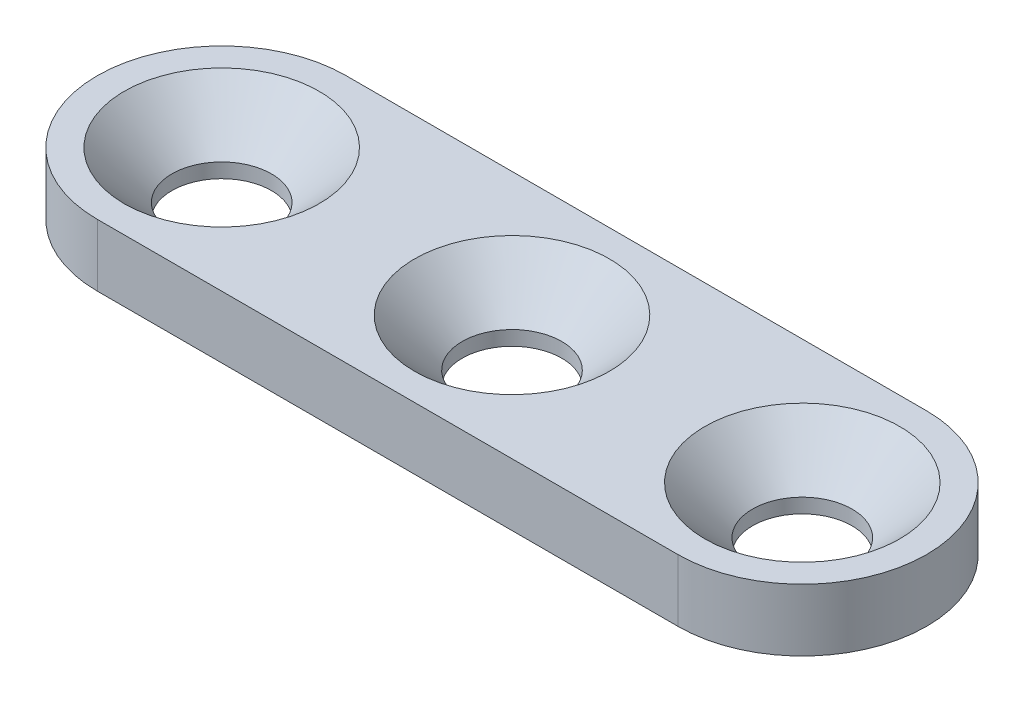
ISO-10303-21;
HEADER;
FILE_DESCRIPTION(('STEP AP214'),'2;1');
FILE_NAME('part.step','',(''),(''),'','','');
FILE_SCHEMA(('AUTOMOTIVE_DESIGN { 1 0 10303 214 1 1 1 1 }'));
ENDSEC;
DATA;
#1=APPLICATION_CONTEXT('core data for automotive mechanical design processes');
#2=APPLICATION_PROTOCOL_DEFINITION('international standard','automotive_design',2000,#1);
#3=PRODUCT_CONTEXT('',#1,'mechanical');
#4=PRODUCT('Part','Part','',(#3));
#5=PRODUCT_RELATED_PRODUCT_CATEGORY('part','',(#4));
#6=PRODUCT_DEFINITION_FORMATION('','',#4);
#7=PRODUCT_DEFINITION_CONTEXT('part definition',#1,'design');
#8=PRODUCT_DEFINITION('design','',#6,#7);
#9=PRODUCT_DEFINITION_SHAPE('','',#8);
#10=(LENGTH_UNIT() NAMED_UNIT(*) SI_UNIT(.MILLI.,.METRE.));
#11=(NAMED_UNIT(*) PLANE_ANGLE_UNIT() SI_UNIT($,.RADIAN.));
#12=(NAMED_UNIT(*) SI_UNIT($,.STERADIAN.) SOLID_ANGLE_UNIT());
#13=UNCERTAINTY_MEASURE_WITH_UNIT(LENGTH_MEASURE(1.E-05),#10,'distance_accuracy_value','');
#14=(GEOMETRIC_REPRESENTATION_CONTEXT(3) GLOBAL_UNCERTAINTY_ASSIGNED_CONTEXT((#13)) GLOBAL_UNIT_ASSIGNED_CONTEXT((#10,
#11,#12)) REPRESENTATION_CONTEXT('',''));
#15=CARTESIAN_POINT('',(0.,0.,0.));
#16=DIRECTION('',(0.,0.,1.));
#17=DIRECTION('',(1.,0.,0.));
#18=AXIS2_PLACEMENT_3D('',#15,#16,#17);
#19=CARTESIAN_POINT('',(-28.,3.,0.));
#20=DIRECTION('',(0.,1.,0.));
#21=DIRECTION('',(0.,0.,1.));
#22=AXIS2_PLACEMENT_3D('',#19,#20,#21);
#23=PLANE('',#22);
#24=CARTESIAN_POINT('',(-28.,3.,0.));
#25=DIRECTION('',(0.,1.,0.));
#26=DIRECTION('',(0.,0.,1.));
#27=AXIS2_PLACEMENT_3D('',#24,#25,#26);
#28=CIRCLE('',#27,4.7);
#29=CARTESIAN_POINT('',(-28.,3.,4.7));
#30=VERTEX_POINT('',#29);
#31=EDGE_CURVE('E195',#30,#30,#28,.T.);
#32=ORIENTED_EDGE('',*,*,#31,.F.);
#33=EDGE_LOOP('',(#32));
#34=FACE_BOUND('',#33,.T.);
#35=CARTESIAN_POINT('',(0.,3.,0.));
#36=DIRECTION('',(0.,1.,0.));
#37=DIRECTION('',(0.,0.,1.));
#38=AXIS2_PLACEMENT_3D('',#35,#36,#37);
#39=CIRCLE('',#38,4.7);
#40=CARTESIAN_POINT('',(0.,3.,4.7));
#41=VERTEX_POINT('',#40);
#42=EDGE_CURVE('E152',#41,#41,#39,.T.);
#43=ORIENTED_EDGE('',*,*,#42,.F.);
#44=EDGE_LOOP('',(#43));
#45=FACE_BOUND('',#44,.T.);
#46=CARTESIAN_POINT('',(-14.,3.,0.));
#47=DIRECTION('',(0.,1.,0.));
#48=DIRECTION('',(0.,0.,1.));
#49=AXIS2_PLACEMENT_3D('',#46,#47,#48);
#50=CIRCLE('',#49,4.7);
#51=CARTESIAN_POINT('',(-14.,3.,4.7));
#52=VERTEX_POINT('',#51);
#53=EDGE_CURVE('E141',#52,#52,#50,.T.);
#54=ORIENTED_EDGE('',*,*,#53,.F.);
#55=EDGE_LOOP('',(#54));
#56=FACE_BOUND('',#55,.T.);
#57=CARTESIAN_POINT('',(-28.,3.,0.));
#58=DIRECTION('',(0.,1.,0.));
#59=DIRECTION('',(0.,0.,1.));
#60=AXIS2_PLACEMENT_3D('',#57,#58,#59);
#61=CIRCLE('',#60,6.);
#62=CARTESIAN_POINT('',(-28.,3.,-6.));
#63=VERTEX_POINT('',#62);
#64=CARTESIAN_POINT('',(-28.,3.,6.));
#65=VERTEX_POINT('',#64);
#66=EDGE_CURVE('E101',#63,#65,#61,.T.);
#67=ORIENTED_EDGE('',*,*,#66,.T.);
#68=DIRECTION('',(1.,0.,0.));
#69=VECTOR('',#68,1.);
#70=CARTESIAN_POINT('',(-28.,3.,6.));
#71=LINE('',#70,#69);
#72=CARTESIAN_POINT('',(0.,3.,6.));
#73=VERTEX_POINT('',#72);
#74=EDGE_CURVE('E97',#65,#73,#71,.T.);
#75=ORIENTED_EDGE('',*,*,#74,.T.);
#76=CARTESIAN_POINT('',(0.,3.,0.));
#77=DIRECTION('',(0.,1.,0.));
#78=DIRECTION('',(0.,0.,1.));
#79=AXIS2_PLACEMENT_3D('',#76,#77,#78);
#80=CIRCLE('',#79,6.);
#81=CARTESIAN_POINT('',(0.,3.,-6.));
#82=VERTEX_POINT('',#81);
#83=EDGE_CURVE('E99',#73,#82,#80,.T.);
#84=ORIENTED_EDGE('',*,*,#83,.T.);
#85=DIRECTION('',(-1.,0.,0.));
#86=VECTOR('',#85,1.);
#87=CARTESIAN_POINT('',(-28.,3.,-6.));
#88=LINE('',#87,#86);
#89=EDGE_CURVE('E67',#82,#63,#88,.T.);
#90=ORIENTED_EDGE('',*,*,#89,.T.);
#91=EDGE_LOOP('',(#67,#75,#84,#90));
#92=FACE_BOUND('',#91,.T.);
#93=ADVANCED_FACE('F47',(#34,#45,#56,#92),#23,.T.);
#94=CARTESIAN_POINT('',(-28.,0.,0.));
#95=DIRECTION('',(0.,1.,0.));
#96=DIRECTION('',(0.,0.,1.));
#97=AXIS2_PLACEMENT_3D('',#94,#95,#96);
#98=PLANE('',#97);
#99=CARTESIAN_POINT('',(-28.,0.,0.));
#100=DIRECTION('',(0.,1.,0.));
#101=DIRECTION('',(0.,0.,1.));
#102=AXIS2_PLACEMENT_3D('',#99,#100,#101);
#103=CIRCLE('',#102,2.39999999999999);
#104=CARTESIAN_POINT('',(-28.,0.,2.39999999999999));
#105=VERTEX_POINT('',#104);
#106=EDGE_CURVE('E51',#105,#105,#103,.T.);
#107=ORIENTED_EDGE('',*,*,#106,.T.);
#108=EDGE_LOOP('',(#107));
#109=FACE_BOUND('',#108,.T.);
#110=CARTESIAN_POINT('',(0.,0.,0.));
#111=DIRECTION('',(0.,1.,0.));
#112=DIRECTION('',(0.,0.,1.));
#113=AXIS2_PLACEMENT_3D('',#110,#111,#112);
#114=CIRCLE('',#113,2.39999999999999);
#115=CARTESIAN_POINT('',(0.,0.,2.39999999999999));
#116=VERTEX_POINT('',#115);
#117=EDGE_CURVE('E138',#116,#116,#114,.T.);
#118=ORIENTED_EDGE('',*,*,#117,.T.);
#119=EDGE_LOOP('',(#118));
#120=FACE_BOUND('',#119,.T.);
#121=CARTESIAN_POINT('',(-14.,0.,0.));
#122=DIRECTION('',(0.,1.,0.));
#123=DIRECTION('',(0.,0.,1.));
#124=AXIS2_PLACEMENT_3D('',#121,#122,#123);
#125=CIRCLE('',#124,2.4);
#126=CARTESIAN_POINT('',(-14.,0.,2.4));
#127=VERTEX_POINT('',#126);
#128=EDGE_CURVE('E124',#127,#127,#125,.T.);
#129=ORIENTED_EDGE('',*,*,#128,.T.);
#130=EDGE_LOOP('',(#129));
#131=FACE_BOUND('',#130,.T.);
#132=CARTESIAN_POINT('',(-28.,0.,0.));
#133=DIRECTION('',(0.,1.,0.));
#134=DIRECTION('',(0.,0.,1.));
#135=AXIS2_PLACEMENT_3D('',#132,#133,#134);
#136=CIRCLE('',#135,6.);
#137=CARTESIAN_POINT('',(-28.,0.,-6.));
#138=VERTEX_POINT('',#137);
#139=CARTESIAN_POINT('',(-28.,0.,6.));
#140=VERTEX_POINT('',#139);
#141=EDGE_CURVE('E120',#138,#140,#136,.T.);
#142=ORIENTED_EDGE('',*,*,#141,.F.);
#143=DIRECTION('',(-1.,0.,0.));
#144=VECTOR('',#143,1.);
#145=CARTESIAN_POINT('',(-28.,0.,-6.));
#146=LINE('',#145,#144);
#147=CARTESIAN_POINT('',(0.,0.,-6.));
#148=VERTEX_POINT('',#147);
#149=EDGE_CURVE('E90',#148,#138,#146,.T.);
#150=ORIENTED_EDGE('',*,*,#149,.F.);
#151=CARTESIAN_POINT('',(0.,0.,0.));
#152=DIRECTION('',(0.,1.,0.));
#153=DIRECTION('',(0.,0.,1.));
#154=AXIS2_PLACEMENT_3D('',#151,#152,#153);
#155=CIRCLE('',#154,6.);
#156=CARTESIAN_POINT('',(0.,0.,6.));
#157=VERTEX_POINT('',#156);
#158=EDGE_CURVE('E84',#157,#148,#155,.T.);
#159=ORIENTED_EDGE('',*,*,#158,.F.);
#160=DIRECTION('',(1.,0.,0.));
#161=VECTOR('',#160,1.);
#162=CARTESIAN_POINT('',(-28.,0.,6.));
#163=LINE('',#162,#161);
#164=EDGE_CURVE('E106',#140,#157,#163,.T.);
#165=ORIENTED_EDGE('',*,*,#164,.F.);
#166=EDGE_LOOP('',(#142,#150,#159,#165));
#167=FACE_BOUND('',#166,.T.);
#168=ADVANCED_FACE('F207',(#109,#120,#131,#167),#98,.F.);
#169=CARTESIAN_POINT('',(-28.,3.,0.));
#170=DIRECTION('',(0.,-1.,0.));
#171=DIRECTION('',(0.,0.,-1.));
#172=AXIS2_PLACEMENT_3D('',#169,#170,#171);
#173=CYLINDRICAL_SURFACE('',#172,6.);
#174=ORIENTED_EDGE('',*,*,#141,.T.);
#175=DIRECTION('',(0.,-1.,0.));
#176=VECTOR('',#175,1.);
#177=CARTESIAN_POINT('',(-28.,3.,6.));
#178=LINE('',#177,#176);
#179=EDGE_CURVE('E11',#65,#140,#178,.T.);
#180=ORIENTED_EDGE('',*,*,#179,.F.);
#181=ORIENTED_EDGE('',*,*,#66,.F.);
#182=DIRECTION('',(0.,-1.,0.));
#183=VECTOR('',#182,1.);
#184=CARTESIAN_POINT('',(-28.,3.,-6.));
#185=LINE('',#184,#183);
#186=EDGE_CURVE('E116',#63,#138,#185,.T.);
#187=ORIENTED_EDGE('',*,*,#186,.T.);
#188=EDGE_LOOP('',(#174,#180,#181,#187));
#189=FACE_BOUND('',#188,.T.);
#190=ADVANCED_FACE('F49',(#189),#173,.T.);
#191=CARTESIAN_POINT('',(-28.,3.,6.));
#192=DIRECTION('',(0.,0.,-1.));
#193=DIRECTION('',(-1.,0.,0.));
#194=AXIS2_PLACEMENT_3D('',#191,#192,#193);
#195=PLANE('',#194);
#196=ORIENTED_EDGE('',*,*,#164,.T.);
#197=DIRECTION('',(0.,-1.,0.));
#198=VECTOR('',#197,1.);
#199=CARTESIAN_POINT('',(0.,3.,6.));
#200=LINE('',#199,#198);
#201=EDGE_CURVE('E58',#73,#157,#200,.T.);
#202=ORIENTED_EDGE('',*,*,#201,.F.);
#203=ORIENTED_EDGE('',*,*,#74,.F.);
#204=ORIENTED_EDGE('',*,*,#179,.T.);
#205=EDGE_LOOP('',(#196,#202,#203,#204));
#206=FACE_BOUND('',#205,.T.);
#207=ADVANCED_FACE('F105',(#206),#195,.F.);
#208=CARTESIAN_POINT('',(0.,3.,0.));
#209=DIRECTION('',(0.,-1.,0.));
#210=DIRECTION('',(0.,0.,-1.));
#211=AXIS2_PLACEMENT_3D('',#208,#209,#210);
#212=CYLINDRICAL_SURFACE('',#211,6.);
#213=ORIENTED_EDGE('',*,*,#158,.T.);
#214=DIRECTION('',(0.,-1.,0.));
#215=VECTOR('',#214,1.);
#216=CARTESIAN_POINT('',(0.,3.,-6.));
#217=LINE('',#216,#215);
#218=EDGE_CURVE('E108',#82,#148,#217,.T.);
#219=ORIENTED_EDGE('',*,*,#218,.F.);
#220=ORIENTED_EDGE('',*,*,#83,.F.);
#221=ORIENTED_EDGE('',*,*,#201,.T.);
#222=EDGE_LOOP('',(#213,#219,#220,#221));
#223=FACE_BOUND('',#222,.T.);
#224=ADVANCED_FACE('F110',(#223),#212,.T.);
#225=CARTESIAN_POINT('',(-28.,3.,-6.));
#226=DIRECTION('',(0.,0.,1.));
#227=DIRECTION('',(1.,0.,0.));
#228=AXIS2_PLACEMENT_3D('',#225,#226,#227);
#229=PLANE('',#228);
#230=ORIENTED_EDGE('',*,*,#149,.T.);
#231=ORIENTED_EDGE('',*,*,#186,.F.);
#232=ORIENTED_EDGE('',*,*,#89,.F.);
#233=ORIENTED_EDGE('',*,*,#218,.T.);
#234=EDGE_LOOP('',(#230,#231,#232,#233));
#235=FACE_BOUND('',#234,.T.);
#236=ADVANCED_FACE('F225',(#235),#229,.F.);
#237=CARTESIAN_POINT('',(-14.,3.,0.));
#238=DIRECTION('',(0.,1.,0.));
#239=DIRECTION('',(0.,0.,1.));
#240=AXIS2_PLACEMENT_3D('',#237,#238,#239);
#241=CYLINDRICAL_SURFACE('',#240,2.4);
#242=CARTESIAN_POINT('',(-14.,0.699999999999993,0.));
#243=DIRECTION('',(0.,1.,0.));
#244=DIRECTION('',(0.,0.,1.));
#245=AXIS2_PLACEMENT_3D('',#242,#243,#244);
#246=CIRCLE('',#245,2.4);
#247=CARTESIAN_POINT('',(-14.,0.699999999999993,2.4));
#248=VERTEX_POINT('',#247);
#249=EDGE_CURVE('E137',#248,#248,#246,.T.);
#250=ORIENTED_EDGE('',*,*,#249,.T.);
#251=EDGE_LOOP('',(#250));
#252=FACE_BOUND('',#251,.T.);
#253=ORIENTED_EDGE('',*,*,#128,.F.);
#254=EDGE_LOOP('',(#253));
#255=FACE_BOUND('',#254,.T.);
#256=ADVANCED_FACE('F216',(#252,#255),#241,.F.);
#257=CARTESIAN_POINT('',(-14.,3.,0.));
#258=DIRECTION('',(0.,1.,0.));
#259=DIRECTION('',(0.,0.,1.));
#260=AXIS2_PLACEMENT_3D('',#257,#258,#259);
#261=CONICAL_SURFACE('',#260,4.7,0.785398163397447);
#262=ORIENTED_EDGE('',*,*,#249,.F.);
#263=EDGE_LOOP('',(#262));
#264=FACE_BOUND('',#263,.T.);
#265=ORIENTED_EDGE('',*,*,#53,.T.);
#266=EDGE_LOOP('',(#265));
#267=FACE_BOUND('',#266,.T.);
#268=ADVANCED_FACE('F213',(#264,#267),#261,.F.);
#269=CARTESIAN_POINT('',(0.,3.,0.));
#270=DIRECTION('',(0.,1.,0.));
#271=DIRECTION('',(0.,0.,1.));
#272=AXIS2_PLACEMENT_3D('',#269,#270,#271);
#273=CYLINDRICAL_SURFACE('',#272,2.39999999999999);
#274=CARTESIAN_POINT('',(0.,0.69999999999999,0.));
#275=DIRECTION('',(0.,1.,0.));
#276=DIRECTION('',(0.,0.,1.));
#277=AXIS2_PLACEMENT_3D('',#274,#275,#276);
#278=CIRCLE('',#277,2.39999999999999);
#279=CARTESIAN_POINT('',(0.,0.69999999999999,2.39999999999999));
#280=VERTEX_POINT('',#279);
#281=EDGE_CURVE('E142',#280,#280,#278,.T.);
#282=ORIENTED_EDGE('',*,*,#281,.T.);
#283=EDGE_LOOP('',(#282));
#284=FACE_BOUND('',#283,.T.);
#285=ORIENTED_EDGE('',*,*,#117,.F.);
#286=EDGE_LOOP('',(#285));
#287=FACE_BOUND('',#286,.T.);
#288=ADVANCED_FACE('F215',(#284,#287),#273,.F.);
#289=CARTESIAN_POINT('',(0.,3.,0.));
#290=DIRECTION('',(0.,1.,0.));
#291=DIRECTION('',(0.,0.,1.));
#292=AXIS2_PLACEMENT_3D('',#289,#290,#291);
#293=CONICAL_SURFACE('',#292,4.7,0.785398163397448);
#294=ORIENTED_EDGE('',*,*,#281,.F.);
#295=EDGE_LOOP('',(#294));
#296=FACE_BOUND('',#295,.T.);
#297=ORIENTED_EDGE('',*,*,#42,.T.);
#298=EDGE_LOOP('',(#297));
#299=FACE_BOUND('',#298,.T.);
#300=ADVANCED_FACE('F223',(#296,#299),#293,.F.);
#301=CARTESIAN_POINT('',(-28.,3.,0.));
#302=DIRECTION('',(0.,1.,0.));
#303=DIRECTION('',(0.,0.,1.));
#304=AXIS2_PLACEMENT_3D('',#301,#302,#303);
#305=CYLINDRICAL_SURFACE('',#304,2.39999999999999);
#306=CARTESIAN_POINT('',(-28.,0.69999999999999,0.));
#307=DIRECTION('',(0.,1.,0.));
#308=DIRECTION('',(0.,0.,1.));
#309=AXIS2_PLACEMENT_3D('',#306,#307,#308);
#310=CIRCLE('',#309,2.39999999999999);
#311=CARTESIAN_POINT('',(-28.,0.69999999999999,2.39999999999999));
#312=VERTEX_POINT('',#311);
#313=EDGE_CURVE('E190',#312,#312,#310,.T.);
#314=ORIENTED_EDGE('',*,*,#313,.T.);
#315=EDGE_LOOP('',(#314));
#316=FACE_BOUND('',#315,.T.);
#317=ORIENTED_EDGE('',*,*,#106,.F.);
#318=EDGE_LOOP('',(#317));
#319=FACE_BOUND('',#318,.T.);
#320=ADVANCED_FACE('F293',(#316,#319),#305,.F.);
#321=CARTESIAN_POINT('',(-28.,3.,0.));
#322=DIRECTION('',(0.,1.,0.));
#323=DIRECTION('',(0.,0.,1.));
#324=AXIS2_PLACEMENT_3D('',#321,#322,#323);
#325=CONICAL_SURFACE('',#324,4.7,0.785398163397448);
#326=ORIENTED_EDGE('',*,*,#313,.F.);
#327=EDGE_LOOP('',(#326));
#328=FACE_BOUND('',#327,.T.);
#329=ORIENTED_EDGE('',*,*,#31,.T.);
#330=EDGE_LOOP('',(#329));
#331=FACE_BOUND('',#330,.T.);
#332=ADVANCED_FACE('F203',(#328,#331),#325,.F.);
#333=CLOSED_SHELL('',(#93,#168,#190,#207,#224,#236,#256,#268,#288,#300,#320,#332));
#334=MANIFOLD_SOLID_BREP('B2',#333);
#335=ADVANCED_BREP_SHAPE_REPRESENTATION('',(#18,#334),#14);
#336=SHAPE_DEFINITION_REPRESENTATION(#9,#335);
ENDSEC;
END-ISO-10303-21;
